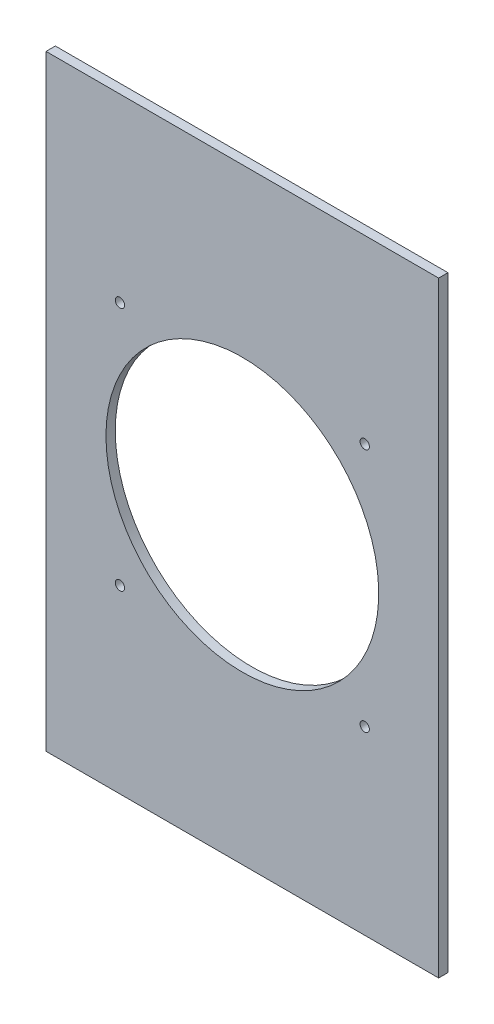
ISO-10303-21;
HEADER;
FILE_DESCRIPTION(('STEP AP214'),'2;1');
FILE_NAME('part.step','',(''),(''),'','','');
FILE_SCHEMA(('AUTOMOTIVE_DESIGN { 1 0 10303 214 1 1 1 1 }'));
ENDSEC;
DATA;
#1=APPLICATION_CONTEXT('core data for automotive mechanical design processes');
#2=APPLICATION_PROTOCOL_DEFINITION('international standard','automotive_design',2000,#1);
#3=PRODUCT_CONTEXT('',#1,'mechanical');
#4=PRODUCT('Part','Part','',(#3));
#5=PRODUCT_RELATED_PRODUCT_CATEGORY('part','',(#4));
#6=PRODUCT_DEFINITION_FORMATION('','',#4);
#7=PRODUCT_DEFINITION_CONTEXT('part definition',#1,'design');
#8=PRODUCT_DEFINITION('design','',#6,#7);
#9=PRODUCT_DEFINITION_SHAPE('','',#8);
#10=(LENGTH_UNIT() NAMED_UNIT(*) SI_UNIT(.MILLI.,.METRE.));
#11=(NAMED_UNIT(*) PLANE_ANGLE_UNIT() SI_UNIT($,.RADIAN.));
#12=(NAMED_UNIT(*) SI_UNIT($,.STERADIAN.) SOLID_ANGLE_UNIT());
#13=UNCERTAINTY_MEASURE_WITH_UNIT(LENGTH_MEASURE(1.E-05),#10,'distance_accuracy_value','');
#14=(GEOMETRIC_REPRESENTATION_CONTEXT(3) GLOBAL_UNCERTAINTY_ASSIGNED_CONTEXT((#13)) GLOBAL_UNIT_ASSIGNED_CONTEXT((#10,
#11,#12)) REPRESENTATION_CONTEXT('',''));
#15=CARTESIAN_POINT('',(0.,0.,0.));
#16=DIRECTION('',(0.,0.,1.));
#17=DIRECTION('',(1.,0.,0.));
#18=AXIS2_PLACEMENT_3D('',#15,#16,#17);
#19=CARTESIAN_POINT('',(84.2,-130.,4.));
#20=DIRECTION('',(-1.,0.,0.));
#21=DIRECTION('',(0.,0.,1.));
#22=AXIS2_PLACEMENT_3D('',#19,#20,#21);
#23=PLANE('',#22);
#24=DIRECTION('',(0.,1.,0.));
#25=VECTOR('',#24,1.);
#26=CARTESIAN_POINT('',(84.2,-130.,0.));
#27=LINE('',#26,#25);
#28=CARTESIAN_POINT('',(84.2,-130.,0.));
#29=VERTEX_POINT('',#28);
#30=CARTESIAN_POINT('',(84.2,130.,0.));
#31=VERTEX_POINT('',#30);
#32=EDGE_CURVE('E110',#29,#31,#27,.T.);
#33=ORIENTED_EDGE('',*,*,#32,.T.);
#34=DIRECTION('',(0.,0.,-1.));
#35=VECTOR('',#34,1.);
#36=CARTESIAN_POINT('',(84.2,130.,4.));
#37=LINE('',#36,#35);
#38=CARTESIAN_POINT('',(84.2,130.,4.));
#39=VERTEX_POINT('',#38);
#40=EDGE_CURVE('E13',#39,#31,#37,.T.);
#41=ORIENTED_EDGE('',*,*,#40,.F.);
#42=DIRECTION('',(0.,1.,0.));
#43=VECTOR('',#42,1.);
#44=CARTESIAN_POINT('',(84.2,-130.,4.));
#45=LINE('',#44,#43);
#46=CARTESIAN_POINT('',(84.2,-130.,4.));
#47=VERTEX_POINT('',#46);
#48=EDGE_CURVE('E98',#47,#39,#45,.T.);
#49=ORIENTED_EDGE('',*,*,#48,.F.);
#50=DIRECTION('',(0.,0.,-1.));
#51=VECTOR('',#50,1.);
#52=CARTESIAN_POINT('',(84.2,-130.,4.));
#53=LINE('',#52,#51);
#54=EDGE_CURVE('E106',#47,#29,#53,.T.);
#55=ORIENTED_EDGE('',*,*,#54,.T.);
#56=EDGE_LOOP('',(#33,#41,#49,#55));
#57=FACE_BOUND('',#56,.T.);
#58=ADVANCED_FACE('F47',(#57),#23,.F.);
#59=CARTESIAN_POINT('',(-84.2,130.,4.));
#60=DIRECTION('',(0.,-1.,0.));
#61=DIRECTION('',(0.,0.,-1.));
#62=AXIS2_PLACEMENT_3D('',#59,#60,#61);
#63=PLANE('',#62);
#64=DIRECTION('',(-1.,0.,0.));
#65=VECTOR('',#64,1.);
#66=CARTESIAN_POINT('',(-84.2,130.,0.));
#67=LINE('',#66,#65);
#68=CARTESIAN_POINT('',(-84.2,130.,0.));
#69=VERTEX_POINT('',#68);
#70=EDGE_CURVE('E102',#31,#69,#67,.T.);
#71=ORIENTED_EDGE('',*,*,#70,.T.);
#72=DIRECTION('',(0.,0.,-1.));
#73=VECTOR('',#72,1.);
#74=CARTESIAN_POINT('',(-84.2,130.,4.));
#75=LINE('',#74,#73);
#76=CARTESIAN_POINT('',(-84.2,130.,4.));
#77=VERTEX_POINT('',#76);
#78=EDGE_CURVE('E55',#77,#69,#75,.T.);
#79=ORIENTED_EDGE('',*,*,#78,.F.);
#80=DIRECTION('',(-1.,0.,0.));
#81=VECTOR('',#80,1.);
#82=CARTESIAN_POINT('',(-84.2,130.,4.));
#83=LINE('',#82,#81);
#84=EDGE_CURVE('E93',#39,#77,#83,.T.);
#85=ORIENTED_EDGE('',*,*,#84,.F.);
#86=ORIENTED_EDGE('',*,*,#40,.T.);
#87=EDGE_LOOP('',(#71,#79,#85,#86));
#88=FACE_BOUND('',#87,.T.);
#89=ADVANCED_FACE('F101',(#88),#63,.F.);
#90=CARTESIAN_POINT('',(-84.2,-130.,4.));
#91=DIRECTION('',(1.,0.,0.));
#92=DIRECTION('',(0.,0.,-1.));
#93=AXIS2_PLACEMENT_3D('',#90,#91,#92);
#94=PLANE('',#93);
#95=DIRECTION('',(0.,-1.,0.));
#96=VECTOR('',#95,1.);
#97=CARTESIAN_POINT('',(-84.2,-130.,0.));
#98=LINE('',#97,#96);
#99=CARTESIAN_POINT('',(-84.2,-130.,0.));
#100=VERTEX_POINT('',#99);
#101=EDGE_CURVE('E80',#69,#100,#98,.T.);
#102=ORIENTED_EDGE('',*,*,#101,.T.);
#103=DIRECTION('',(0.,0.,-1.));
#104=VECTOR('',#103,1.);
#105=CARTESIAN_POINT('',(-84.2,-130.,4.));
#106=LINE('',#105,#104);
#107=CARTESIAN_POINT('',(-84.2,-130.,4.));
#108=VERTEX_POINT('',#107);
#109=EDGE_CURVE('E103',#108,#100,#106,.T.);
#110=ORIENTED_EDGE('',*,*,#109,.F.);
#111=DIRECTION('',(0.,-1.,0.));
#112=VECTOR('',#111,1.);
#113=CARTESIAN_POINT('',(-84.2,-130.,4.));
#114=LINE('',#113,#112);
#115=EDGE_CURVE('E96',#77,#108,#114,.T.);
#116=ORIENTED_EDGE('',*,*,#115,.F.);
#117=ORIENTED_EDGE('',*,*,#78,.T.);
#118=EDGE_LOOP('',(#102,#110,#116,#117));
#119=FACE_BOUND('',#118,.T.);
#120=ADVANCED_FACE('F104',(#119),#94,.F.);
#121=CARTESIAN_POINT('',(-84.2,-130.,4.));
#122=DIRECTION('',(0.,1.,0.));
#123=DIRECTION('',(0.,0.,1.));
#124=AXIS2_PLACEMENT_3D('',#121,#122,#123);
#125=PLANE('',#124);
#126=DIRECTION('',(1.,0.,0.));
#127=VECTOR('',#126,1.);
#128=CARTESIAN_POINT('',(-84.2,-130.,0.));
#129=LINE('',#128,#127);
#130=EDGE_CURVE('E86',#100,#29,#129,.T.);
#131=ORIENTED_EDGE('',*,*,#130,.T.);
#132=ORIENTED_EDGE('',*,*,#54,.F.);
#133=DIRECTION('',(1.,0.,0.));
#134=VECTOR('',#133,1.);
#135=CARTESIAN_POINT('',(-84.2,-130.,4.));
#136=LINE('',#135,#134);
#137=EDGE_CURVE('E63',#108,#47,#136,.T.);
#138=ORIENTED_EDGE('',*,*,#137,.F.);
#139=ORIENTED_EDGE('',*,*,#109,.T.);
#140=EDGE_LOOP('',(#131,#132,#138,#139));
#141=FACE_BOUND('',#140,.T.);
#142=ADVANCED_FACE('F118',(#141),#125,.F.);
#143=CARTESIAN_POINT('',(0.,0.,4.));
#144=DIRECTION('',(0.,0.,-1.));
#145=DIRECTION('',(-1.,0.,0.));
#146=AXIS2_PLACEMENT_3D('',#143,#144,#145);
#147=PLANE('',#146);
#148=CARTESIAN_POINT('',(-52.5,52.5000000000001,4.));
#149=DIRECTION('',(0.,0.,-1.));
#150=DIRECTION('',(-1.,0.,0.));
#151=AXIS2_PLACEMENT_3D('',#148,#149,#150);
#152=CIRCLE('',#151,2.);
#153=CARTESIAN_POINT('',(-54.5,52.5000000000001,4.));
#154=VERTEX_POINT('',#153);
#155=EDGE_CURVE('E113',#154,#154,#152,.F.);
#156=ORIENTED_EDGE('',*,*,#155,.F.);
#157=EDGE_LOOP('',(#156));
#158=FACE_BOUND('',#157,.T.);
#159=CARTESIAN_POINT('',(52.5,52.5000000000001,4.));
#160=DIRECTION('',(0.,0.,-1.));
#161=DIRECTION('',(-1.,0.,0.));
#162=AXIS2_PLACEMENT_3D('',#159,#160,#161);
#163=CIRCLE('',#162,2.);
#164=CARTESIAN_POINT('',(50.5,52.5000000000001,4.));
#165=VERTEX_POINT('',#164);
#166=EDGE_CURVE('E126',#165,#165,#163,.F.);
#167=ORIENTED_EDGE('',*,*,#166,.F.);
#168=EDGE_LOOP('',(#167));
#169=FACE_BOUND('',#168,.T.);
#170=CARTESIAN_POINT('',(52.5,-52.4999999999999,4.));
#171=DIRECTION('',(0.,0.,-1.));
#172=DIRECTION('',(-1.,0.,0.));
#173=AXIS2_PLACEMENT_3D('',#170,#171,#172);
#174=CIRCLE('',#173,2.);
#175=CARTESIAN_POINT('',(50.5,-52.4999999999999,4.));
#176=VERTEX_POINT('',#175);
#177=EDGE_CURVE('E129',#176,#176,#174,.F.);
#178=ORIENTED_EDGE('',*,*,#177,.F.);
#179=EDGE_LOOP('',(#178));
#180=FACE_BOUND('',#179,.T.);
#181=CARTESIAN_POINT('',(-52.5,-52.4999999999999,4.));
#182=DIRECTION('',(0.,0.,-1.));
#183=DIRECTION('',(-1.,0.,0.));
#184=AXIS2_PLACEMENT_3D('',#181,#182,#183);
#185=CIRCLE('',#184,2.);
#186=CARTESIAN_POINT('',(-54.5,-52.4999999999999,4.));
#187=VERTEX_POINT('',#186);
#188=EDGE_CURVE('E132',#187,#187,#185,.F.);
#189=ORIENTED_EDGE('',*,*,#188,.F.);
#190=EDGE_LOOP('',(#189));
#191=FACE_BOUND('',#190,.T.);
#192=CARTESIAN_POINT('',(0.,0.,4.));
#193=DIRECTION('',(0.,0.,-1.));
#194=DIRECTION('',(-1.,0.,0.));
#195=AXIS2_PLACEMENT_3D('',#192,#193,#194);
#196=CIRCLE('',#195,58.5);
#197=CARTESIAN_POINT('',(-58.5,0.,4.));
#198=VERTEX_POINT('',#197);
#199=EDGE_CURVE('E135',#198,#198,#196,.F.);
#200=ORIENTED_EDGE('',*,*,#199,.F.);
#201=EDGE_LOOP('',(#200));
#202=FACE_BOUND('',#201,.T.);
#203=ORIENTED_EDGE('',*,*,#48,.T.);
#204=ORIENTED_EDGE('',*,*,#84,.T.);
#205=ORIENTED_EDGE('',*,*,#115,.T.);
#206=ORIENTED_EDGE('',*,*,#137,.T.);
#207=EDGE_LOOP('',(#203,#204,#205,#206));
#208=FACE_BOUND('',#207,.T.);
#209=ADVANCED_FACE('F94',(#158,#169,#180,#191,#202,#208),#147,.F.);
#210=CARTESIAN_POINT('',(0.,0.,0.));
#211=DIRECTION('',(0.,0.,-1.));
#212=DIRECTION('',(-1.,0.,0.));
#213=AXIS2_PLACEMENT_3D('',#210,#211,#212);
#214=PLANE('',#213);
#215=CARTESIAN_POINT('',(-52.5,52.5000000000001,0.));
#216=DIRECTION('',(0.,0.,1.));
#217=DIRECTION('',(1.,0.,0.));
#218=AXIS2_PLACEMENT_3D('',#215,#216,#217);
#219=CIRCLE('',#218,2.);
#220=CARTESIAN_POINT('',(-50.5,52.5000000000001,0.));
#221=VERTEX_POINT('',#220);
#222=EDGE_CURVE('E142',#221,#221,#219,.T.);
#223=ORIENTED_EDGE('',*,*,#222,.T.);
#224=EDGE_LOOP('',(#223));
#225=FACE_BOUND('',#224,.T.);
#226=CARTESIAN_POINT('',(52.5,52.5000000000001,0.));
#227=DIRECTION('',(0.,0.,1.));
#228=DIRECTION('',(1.,0.,0.));
#229=AXIS2_PLACEMENT_3D('',#226,#227,#228);
#230=CIRCLE('',#229,2.);
#231=CARTESIAN_POINT('',(54.5,52.5000000000001,0.));
#232=VERTEX_POINT('',#231);
#233=EDGE_CURVE('E145',#232,#232,#230,.T.);
#234=ORIENTED_EDGE('',*,*,#233,.T.);
#235=EDGE_LOOP('',(#234));
#236=FACE_BOUND('',#235,.T.);
#237=CARTESIAN_POINT('',(52.5,-52.4999999999999,0.));
#238=DIRECTION('',(0.,0.,1.));
#239=DIRECTION('',(1.,0.,0.));
#240=AXIS2_PLACEMENT_3D('',#237,#238,#239);
#241=CIRCLE('',#240,2.);
#242=CARTESIAN_POINT('',(54.5,-52.4999999999999,0.));
#243=VERTEX_POINT('',#242);
#244=EDGE_CURVE('E148',#243,#243,#241,.T.);
#245=ORIENTED_EDGE('',*,*,#244,.T.);
#246=EDGE_LOOP('',(#245));
#247=FACE_BOUND('',#246,.T.);
#248=CARTESIAN_POINT('',(-52.5,-52.4999999999999,0.));
#249=DIRECTION('',(0.,0.,1.));
#250=DIRECTION('',(1.,0.,0.));
#251=AXIS2_PLACEMENT_3D('',#248,#249,#250);
#252=CIRCLE('',#251,2.);
#253=CARTESIAN_POINT('',(-50.5,-52.4999999999999,0.));
#254=VERTEX_POINT('',#253);
#255=EDGE_CURVE('E141',#254,#254,#252,.T.);
#256=ORIENTED_EDGE('',*,*,#255,.T.);
#257=EDGE_LOOP('',(#256));
#258=FACE_BOUND('',#257,.T.);
#259=CARTESIAN_POINT('',(0.,0.,0.));
#260=DIRECTION('',(0.,0.,1.));
#261=DIRECTION('',(1.,0.,0.));
#262=AXIS2_PLACEMENT_3D('',#259,#260,#261);
#263=CIRCLE('',#262,58.5);
#264=CARTESIAN_POINT('',(58.5,0.,0.));
#265=VERTEX_POINT('',#264);
#266=EDGE_CURVE('E138',#265,#265,#263,.T.);
#267=ORIENTED_EDGE('',*,*,#266,.T.);
#268=EDGE_LOOP('',(#267));
#269=FACE_BOUND('',#268,.T.);
#270=ORIENTED_EDGE('',*,*,#32,.F.);
#271=ORIENTED_EDGE('',*,*,#130,.F.);
#272=ORIENTED_EDGE('',*,*,#101,.F.);
#273=ORIENTED_EDGE('',*,*,#70,.F.);
#274=EDGE_LOOP('',(#270,#271,#272,#273));
#275=FACE_BOUND('',#274,.T.);
#276=ADVANCED_FACE('F121',(#225,#236,#247,#258,#269,#275),#214,.T.);
#277=CARTESIAN_POINT('',(0.,0.,24.5));
#278=DIRECTION('',(0.,0.,-1.));
#279=DIRECTION('',(-1.,0.,0.));
#280=AXIS2_PLACEMENT_3D('',#277,#278,#279);
#281=CYLINDRICAL_SURFACE('',#280,58.5);
#282=ORIENTED_EDGE('',*,*,#266,.F.);
#283=EDGE_LOOP('',(#282));
#284=FACE_BOUND('',#283,.T.);
#285=ORIENTED_EDGE('',*,*,#199,.T.);
#286=EDGE_LOOP('',(#285));
#287=FACE_BOUND('',#286,.T.);
#288=ADVANCED_FACE('F160',(#284,#287),#281,.F.);
#289=CARTESIAN_POINT('',(-52.5,-52.4999999999999,24.5));
#290=DIRECTION('',(0.,0.,-1.));
#291=DIRECTION('',(-1.,0.,0.));
#292=AXIS2_PLACEMENT_3D('',#289,#290,#291);
#293=CYLINDRICAL_SURFACE('',#292,2.);
#294=ORIENTED_EDGE('',*,*,#255,.F.);
#295=EDGE_LOOP('',(#294));
#296=FACE_BOUND('',#295,.T.);
#297=ORIENTED_EDGE('',*,*,#188,.T.);
#298=EDGE_LOOP('',(#297));
#299=FACE_BOUND('',#298,.T.);
#300=ADVANCED_FACE('F156',(#296,#299),#293,.F.);
#301=CARTESIAN_POINT('',(52.5,-52.4999999999999,24.5));
#302=DIRECTION('',(0.,0.,-1.));
#303=DIRECTION('',(-1.,0.,0.));
#304=AXIS2_PLACEMENT_3D('',#301,#302,#303);
#305=CYLINDRICAL_SURFACE('',#304,2.);
#306=ORIENTED_EDGE('',*,*,#244,.F.);
#307=EDGE_LOOP('',(#306));
#308=FACE_BOUND('',#307,.T.);
#309=ORIENTED_EDGE('',*,*,#177,.T.);
#310=EDGE_LOOP('',(#309));
#311=FACE_BOUND('',#310,.T.);
#312=ADVANCED_FACE('F159',(#308,#311),#305,.F.);
#313=CARTESIAN_POINT('',(52.5,52.5000000000001,24.5));
#314=DIRECTION('',(0.,0.,-1.));
#315=DIRECTION('',(-1.,0.,0.));
#316=AXIS2_PLACEMENT_3D('',#313,#314,#315);
#317=CYLINDRICAL_SURFACE('',#316,2.);
#318=ORIENTED_EDGE('',*,*,#233,.F.);
#319=EDGE_LOOP('',(#318));
#320=FACE_BOUND('',#319,.T.);
#321=ORIENTED_EDGE('',*,*,#166,.T.);
#322=EDGE_LOOP('',(#321));
#323=FACE_BOUND('',#322,.T.);
#324=ADVANCED_FACE('F221',(#320,#323),#317,.F.);
#325=CARTESIAN_POINT('',(-52.5,52.5000000000001,24.5));
#326=DIRECTION('',(0.,0.,-1.));
#327=DIRECTION('',(-1.,0.,0.));
#328=AXIS2_PLACEMENT_3D('',#325,#326,#327);
#329=CYLINDRICAL_SURFACE('',#328,2.);
#330=ORIENTED_EDGE('',*,*,#222,.F.);
#331=EDGE_LOOP('',(#330));
#332=FACE_BOUND('',#331,.T.);
#333=ORIENTED_EDGE('',*,*,#155,.T.);
#334=EDGE_LOOP('',(#333));
#335=FACE_BOUND('',#334,.T.);
#336=ADVANCED_FACE('F231',(#332,#335),#329,.F.);
#337=CLOSED_SHELL('',(#58,#89,#120,#142,#209,#276,#288,#300,#312,#324,#336));
#338=MANIFOLD_SOLID_BREP('B2',#337);
#339=ADVANCED_BREP_SHAPE_REPRESENTATION('',(#18,#338),#14);
#340=SHAPE_DEFINITION_REPRESENTATION(#9,#339);
ENDSEC;
END-ISO-10303-21;
